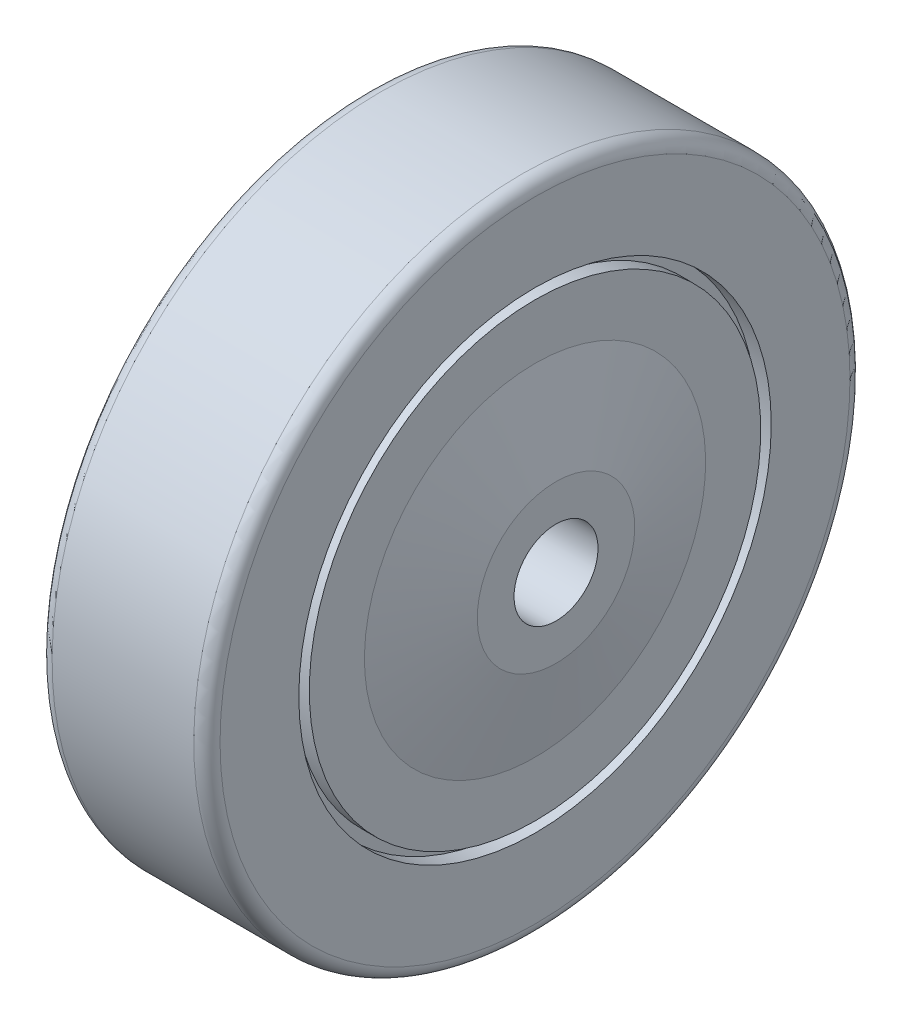
ISO-10303-21;
HEADER;
FILE_DESCRIPTION(('STEP AP214'),'2;1');
FILE_NAME('part.step','',(''),(''),'','','');
FILE_SCHEMA(('AUTOMOTIVE_DESIGN { 1 0 10303 214 1 1 1 1 }'));
ENDSEC;
DATA;
#1=APPLICATION_CONTEXT('core data for automotive mechanical design processes');
#2=APPLICATION_PROTOCOL_DEFINITION('international standard','automotive_design',2000,#1);
#3=PRODUCT_CONTEXT('',#1,'mechanical');
#4=PRODUCT('Part','Part','',(#3));
#5=PRODUCT_RELATED_PRODUCT_CATEGORY('part','',(#4));
#6=PRODUCT_DEFINITION_FORMATION('','',#4);
#7=PRODUCT_DEFINITION_CONTEXT('part definition',#1,'design');
#8=PRODUCT_DEFINITION('design','',#6,#7);
#9=PRODUCT_DEFINITION_SHAPE('','',#8);
#10=(LENGTH_UNIT() NAMED_UNIT(*) SI_UNIT(.MILLI.,.METRE.));
#11=(NAMED_UNIT(*) PLANE_ANGLE_UNIT() SI_UNIT($,.RADIAN.));
#12=(NAMED_UNIT(*) SI_UNIT($,.STERADIAN.) SOLID_ANGLE_UNIT());
#13=UNCERTAINTY_MEASURE_WITH_UNIT(LENGTH_MEASURE(1.E-05),#10,'distance_accuracy_value','');
#14=(GEOMETRIC_REPRESENTATION_CONTEXT(3) GLOBAL_UNCERTAINTY_ASSIGNED_CONTEXT((#13)) GLOBAL_UNIT_ASSIGNED_CONTEXT((#10,
#11,#12)) REPRESENTATION_CONTEXT('',''));
#15=CARTESIAN_POINT('',(0.,0.,0.));
#16=DIRECTION('',(0.,0.,1.));
#17=DIRECTION('',(1.,0.,0.));
#18=AXIS2_PLACEMENT_3D('',#15,#16,#17);
#19=CARTESIAN_POINT('',(-20.,0.,0.));
#20=DIRECTION('',(1.,0.,0.));
#21=DIRECTION('',(0.,1.,0.));
#22=AXIS2_PLACEMENT_3D('',#19,#20,#21);
#23=CYLINDRICAL_SURFACE('',#22,8.);
#24=CARTESIAN_POINT('',(20.,0.,0.));
#25=DIRECTION('',(-1.,0.,0.));
#26=DIRECTION('',(0.,1.,0.));
#27=AXIS2_PLACEMENT_3D('',#24,#25,#26);
#28=CIRCLE('',#27,8.);
#29=CARTESIAN_POINT('',(20.,8.00000000000001,0.));
#30=VERTEX_POINT('',#29);
#31=EDGE_CURVE('E67',#30,#30,#28,.T.);
#32=ORIENTED_EDGE('',*,*,#31,.F.);
#33=EDGE_LOOP('',(#32));
#34=FACE_BOUND('',#33,.T.);
#35=CARTESIAN_POINT('',(-20.,0.,0.));
#36=DIRECTION('',(1.,0.,0.));
#37=DIRECTION('',(0.,1.,0.));
#38=AXIS2_PLACEMENT_3D('',#35,#36,#37);
#39=CIRCLE('',#38,8.);
#40=CARTESIAN_POINT('',(-20.,7.99999999999999,0.));
#41=VERTEX_POINT('',#40);
#42=EDGE_CURVE('E30',#41,#41,#39,.T.);
#43=ORIENTED_EDGE('',*,*,#42,.F.);
#44=EDGE_LOOP('',(#43));
#45=FACE_BOUND('',#44,.T.);
#46=ADVANCED_FACE('F14',(#34,#45),#23,.F.);
#47=CARTESIAN_POINT('',(14.5714506781853,0.,0.));
#48=DIRECTION('',(-1.,0.,0.));
#49=DIRECTION('',(0.,1.,0.));
#50=AXIS2_PLACEMENT_3D('',#47,#48,#49);
#51=CYLINDRICAL_SURFACE('',#50,42.9998065658785);
#52=CARTESIAN_POINT('',(16.,0.,0.));
#53=DIRECTION('',(-1.,0.,0.));
#54=DIRECTION('',(0.,1.,0.));
#55=AXIS2_PLACEMENT_3D('',#52,#53,#54);
#56=CIRCLE('',#55,42.9998065658785);
#57=CARTESIAN_POINT('',(16.,42.9998065658785,0.));
#58=VERTEX_POINT('',#57);
#59=EDGE_CURVE('E10',#58,#58,#56,.T.);
#60=ORIENTED_EDGE('',*,*,#59,.T.);
#61=EDGE_LOOP('',(#60));
#62=FACE_BOUND('',#61,.T.);
#63=CARTESIAN_POINT('',(13.1429013563706,0.,0.));
#64=DIRECTION('',(-1.,0.,0.));
#65=DIRECTION('',(0.,1.,0.));
#66=AXIS2_PLACEMENT_3D('',#63,#64,#65);
#67=CIRCLE('',#66,42.9998065658785);
#68=CARTESIAN_POINT('',(13.1429013563706,42.9998065658785,0.));
#69=VERTEX_POINT('',#68);
#70=EDGE_CURVE('E22',#69,#69,#67,.T.);
#71=ORIENTED_EDGE('',*,*,#70,.F.);
#72=EDGE_LOOP('',(#71));
#73=FACE_BOUND('',#72,.T.);
#74=ADVANCED_FACE('F92',(#62,#73),#51,.T.);
#75=CARTESIAN_POINT('',(13.1429013563706,-44.9998065658785,0.));
#76=DIRECTION('',(1.,0.,0.));
#77=DIRECTION('',(0.,1.,0.));
#78=AXIS2_PLACEMENT_3D('',#75,#76,#77);
#79=PLANE('',#78);
#80=ORIENTED_EDGE('',*,*,#70,.T.);
#81=EDGE_LOOP('',(#80));
#82=FACE_BOUND('',#81,.T.);
#83=CARTESIAN_POINT('',(13.1429013563706,0.,0.));
#84=DIRECTION('',(-1.,0.,0.));
#85=DIRECTION('',(0.,1.,0.));
#86=AXIS2_PLACEMENT_3D('',#83,#84,#85);
#87=CIRCLE('',#86,44.9998065658785);
#88=CARTESIAN_POINT('',(13.1429013563706,44.9998065658785,0.));
#89=VERTEX_POINT('',#88);
#90=EDGE_CURVE('E27',#89,#89,#87,.T.);
#91=ORIENTED_EDGE('',*,*,#90,.F.);
#92=EDGE_LOOP('',(#91));
#93=FACE_BOUND('',#92,.T.);
#94=ADVANCED_FACE('F99',(#82,#93),#79,.T.);
#95=CARTESIAN_POINT('',(14.5714506781853,0.,0.));
#96=DIRECTION('',(-1.,0.,0.));
#97=DIRECTION('',(0.,1.,0.));
#98=AXIS2_PLACEMENT_3D('',#95,#96,#97);
#99=CYLINDRICAL_SURFACE('',#98,44.9998065658785);
#100=ORIENTED_EDGE('',*,*,#90,.T.);
#101=EDGE_LOOP('',(#100));
#102=FACE_BOUND('',#101,.T.);
#103=CARTESIAN_POINT('',(16.,0.,0.));
#104=DIRECTION('',(-1.,0.,0.));
#105=DIRECTION('',(0.,1.,0.));
#106=AXIS2_PLACEMENT_3D('',#103,#104,#105);
#107=CIRCLE('',#106,44.9998065658785);
#108=CARTESIAN_POINT('',(16.,44.9998065658785,0.));
#109=VERTEX_POINT('',#108);
#110=EDGE_CURVE('E35',#109,#109,#107,.T.);
#111=ORIENTED_EDGE('',*,*,#110,.F.);
#112=EDGE_LOOP('',(#111));
#113=FACE_BOUND('',#112,.T.);
#114=ADVANCED_FACE('F111',(#102,#113),#99,.F.);
#115=CARTESIAN_POINT('',(16.,-60.,0.));
#116=DIRECTION('',(1.,0.,0.));
#117=DIRECTION('',(0.,1.,0.));
#118=AXIS2_PLACEMENT_3D('',#115,#116,#117);
#119=PLANE('',#118);
#120=ORIENTED_EDGE('',*,*,#110,.T.);
#121=EDGE_LOOP('',(#120));
#122=FACE_BOUND('',#121,.T.);
#123=CARTESIAN_POINT('',(16.,0.,0.));
#124=DIRECTION('',(-1.,0.,0.));
#125=DIRECTION('',(0.,1.,0.));
#126=AXIS2_PLACEMENT_3D('',#123,#124,#125);
#127=CIRCLE('',#126,60.);
#128=CARTESIAN_POINT('',(16.,60.,0.));
#129=VERTEX_POINT('',#128);
#130=EDGE_CURVE('E38',#129,#129,#127,.T.);
#131=ORIENTED_EDGE('',*,*,#130,.F.);
#132=EDGE_LOOP('',(#131));
#133=FACE_BOUND('',#132,.T.);
#134=ADVANCED_FACE('F114',(#122,#133),#119,.T.);
#135=CARTESIAN_POINT('',(13.5,0.,0.));
#136=DIRECTION('',(-1.,0.,0.));
#137=DIRECTION('',(0.,1.,0.));
#138=AXIS2_PLACEMENT_3D('',#135,#136,#137);
#139=TOROIDAL_SURFACE('',#138,60.,2.5);
#140=ORIENTED_EDGE('',*,*,#130,.T.);
#141=EDGE_LOOP('',(#140));
#142=FACE_BOUND('',#141,.T.);
#143=CARTESIAN_POINT('',(13.5,0.,0.));
#144=DIRECTION('',(-1.,0.,0.));
#145=DIRECTION('',(0.,1.,0.));
#146=AXIS2_PLACEMENT_3D('',#143,#144,#145);
#147=CIRCLE('',#146,62.5);
#148=CARTESIAN_POINT('',(13.5,62.5,0.));
#149=VERTEX_POINT('',#148);
#150=EDGE_CURVE('E41',#149,#149,#147,.T.);
#151=ORIENTED_EDGE('',*,*,#150,.F.);
#152=EDGE_LOOP('',(#151));
#153=FACE_BOUND('',#152,.T.);
#154=ADVANCED_FACE('F142',(#142,#153),#139,.T.);
#155=CARTESIAN_POINT('',(0.,0.,0.));
#156=DIRECTION('',(-1.,0.,0.));
#157=DIRECTION('',(0.,1.,0.));
#158=AXIS2_PLACEMENT_3D('',#155,#156,#157);
#159=CYLINDRICAL_SURFACE('',#158,62.5);
#160=ORIENTED_EDGE('',*,*,#150,.T.);
#161=EDGE_LOOP('',(#160));
#162=FACE_BOUND('',#161,.T.);
#163=CARTESIAN_POINT('',(-13.5,0.,0.));
#164=DIRECTION('',(-1.,0.,0.));
#165=DIRECTION('',(0.,1.,0.));
#166=AXIS2_PLACEMENT_3D('',#163,#164,#165);
#167=CIRCLE('',#166,62.5);
#168=CARTESIAN_POINT('',(-13.5,62.5,0.));
#169=VERTEX_POINT('',#168);
#170=EDGE_CURVE('E44',#169,#169,#167,.T.);
#171=ORIENTED_EDGE('',*,*,#170,.F.);
#172=EDGE_LOOP('',(#171));
#173=FACE_BOUND('',#172,.T.);
#174=ADVANCED_FACE('F140',(#162,#173),#159,.T.);
#175=CARTESIAN_POINT('',(-13.5,0.,0.));
#176=DIRECTION('',(-1.,0.,0.));
#177=DIRECTION('',(0.,1.,0.));
#178=AXIS2_PLACEMENT_3D('',#175,#176,#177);
#179=TOROIDAL_SURFACE('',#178,60.,2.5);
#180=ORIENTED_EDGE('',*,*,#170,.T.);
#181=EDGE_LOOP('',(#180));
#182=FACE_BOUND('',#181,.T.);
#183=CARTESIAN_POINT('',(-16.,0.,0.));
#184=DIRECTION('',(-1.,0.,0.));
#185=DIRECTION('',(0.,1.,0.));
#186=AXIS2_PLACEMENT_3D('',#183,#184,#185);
#187=CIRCLE('',#186,60.);
#188=CARTESIAN_POINT('',(-16.,60.,0.));
#189=VERTEX_POINT('',#188);
#190=EDGE_CURVE('E47',#189,#189,#187,.T.);
#191=ORIENTED_EDGE('',*,*,#190,.F.);
#192=EDGE_LOOP('',(#191));
#193=FACE_BOUND('',#192,.T.);
#194=ADVANCED_FACE('F141',(#182,#193),#179,.T.);
#195=CARTESIAN_POINT('',(-16.,-44.9998065658785,0.));
#196=DIRECTION('',(-1.,0.,0.));
#197=DIRECTION('',(0.,-1.,0.));
#198=AXIS2_PLACEMENT_3D('',#195,#196,#197);
#199=PLANE('',#198);
#200=ORIENTED_EDGE('',*,*,#190,.T.);
#201=EDGE_LOOP('',(#200));
#202=FACE_BOUND('',#201,.T.);
#203=CARTESIAN_POINT('',(-16.,0.,0.));
#204=DIRECTION('',(-1.,0.,0.));
#205=DIRECTION('',(0.,1.,0.));
#206=AXIS2_PLACEMENT_3D('',#203,#204,#205);
#207=CIRCLE('',#206,44.9998065658785);
#208=CARTESIAN_POINT('',(-16.,44.9998065658785,0.));
#209=VERTEX_POINT('',#208);
#210=EDGE_CURVE('E50',#209,#209,#207,.T.);
#211=ORIENTED_EDGE('',*,*,#210,.F.);
#212=EDGE_LOOP('',(#211));
#213=FACE_BOUND('',#212,.T.);
#214=ADVANCED_FACE('F118',(#202,#213),#199,.T.);
#215=CARTESIAN_POINT('',(-14.5714506781853,0.,0.));
#216=DIRECTION('',(-1.,0.,0.));
#217=DIRECTION('',(0.,1.,0.));
#218=AXIS2_PLACEMENT_3D('',#215,#216,#217);
#219=CYLINDRICAL_SURFACE('',#218,44.9998065658785);
#220=ORIENTED_EDGE('',*,*,#210,.T.);
#221=EDGE_LOOP('',(#220));
#222=FACE_BOUND('',#221,.T.);
#223=CARTESIAN_POINT('',(-13.1429013563707,0.,0.));
#224=DIRECTION('',(-1.,0.,0.));
#225=DIRECTION('',(0.,1.,0.));
#226=AXIS2_PLACEMENT_3D('',#223,#224,#225);
#227=CIRCLE('',#226,44.9998065658785);
#228=CARTESIAN_POINT('',(-13.1429013563707,44.9998065658785,0.));
#229=VERTEX_POINT('',#228);
#230=EDGE_CURVE('E53',#229,#229,#227,.T.);
#231=ORIENTED_EDGE('',*,*,#230,.F.);
#232=EDGE_LOOP('',(#231));
#233=FACE_BOUND('',#232,.T.);
#234=ADVANCED_FACE('F116',(#222,#233),#219,.F.);
#235=CARTESIAN_POINT('',(-13.1429013563706,-42.9998065658785,0.));
#236=DIRECTION('',(-1.,0.,0.));
#237=DIRECTION('',(0.,-1.,0.));
#238=AXIS2_PLACEMENT_3D('',#235,#236,#237);
#239=PLANE('',#238);
#240=ORIENTED_EDGE('',*,*,#230,.T.);
#241=EDGE_LOOP('',(#240));
#242=FACE_BOUND('',#241,.T.);
#243=CARTESIAN_POINT('',(-13.1429013563707,0.,0.));
#244=DIRECTION('',(-1.,0.,0.));
#245=DIRECTION('',(0.,1.,0.));
#246=AXIS2_PLACEMENT_3D('',#243,#244,#245);
#247=CIRCLE('',#246,42.9998065658785);
#248=CARTESIAN_POINT('',(-13.1429013563707,42.9998065658785,0.));
#249=VERTEX_POINT('',#248);
#250=EDGE_CURVE('E56',#249,#249,#247,.T.);
#251=ORIENTED_EDGE('',*,*,#250,.F.);
#252=EDGE_LOOP('',(#251));
#253=FACE_BOUND('',#252,.T.);
#254=ADVANCED_FACE('F109',(#242,#253),#239,.T.);
#255=CARTESIAN_POINT('',(-14.5714506781853,0.,0.));
#256=DIRECTION('',(-1.,0.,0.));
#257=DIRECTION('',(0.,1.,0.));
#258=AXIS2_PLACEMENT_3D('',#255,#256,#257);
#259=CYLINDRICAL_SURFACE('',#258,42.9998065658785);
#260=ORIENTED_EDGE('',*,*,#250,.T.);
#261=EDGE_LOOP('',(#260));
#262=FACE_BOUND('',#261,.T.);
#263=CARTESIAN_POINT('',(-16.,0.,0.));
#264=DIRECTION('',(-1.,0.,0.));
#265=DIRECTION('',(0.,1.,0.));
#266=AXIS2_PLACEMENT_3D('',#263,#264,#265);
#267=CIRCLE('',#266,42.9998065658785);
#268=CARTESIAN_POINT('',(-16.,42.9998065658785,0.));
#269=VERTEX_POINT('',#268);
#270=EDGE_CURVE('E59',#269,#269,#267,.T.);
#271=ORIENTED_EDGE('',*,*,#270,.F.);
#272=EDGE_LOOP('',(#271));
#273=FACE_BOUND('',#272,.T.);
#274=ADVANCED_FACE('F105',(#262,#273),#259,.T.);
#275=CARTESIAN_POINT('',(-16.,-32.5,0.));
#276=DIRECTION('',(-1.,0.,0.));
#277=DIRECTION('',(0.,-1.,0.));
#278=AXIS2_PLACEMENT_3D('',#275,#276,#277);
#279=PLANE('',#278);
#280=ORIENTED_EDGE('',*,*,#270,.T.);
#281=EDGE_LOOP('',(#280));
#282=FACE_BOUND('',#281,.T.);
#283=CARTESIAN_POINT('',(-16.,0.,0.));
#284=DIRECTION('',(-1.,0.,0.));
#285=DIRECTION('',(0.,1.,0.));
#286=AXIS2_PLACEMENT_3D('',#283,#284,#285);
#287=CIRCLE('',#286,32.5);
#288=CARTESIAN_POINT('',(-16.,32.5,0.));
#289=VERTEX_POINT('',#288);
#290=EDGE_CURVE('E62',#289,#289,#287,.T.);
#291=ORIENTED_EDGE('',*,*,#290,.F.);
#292=EDGE_LOOP('',(#291));
#293=FACE_BOUND('',#292,.T.);
#294=ADVANCED_FACE('F108',(#282,#293),#279,.T.);
#295=CARTESIAN_POINT('',(-18.,0.,0.));
#296=DIRECTION('',(1.,0.,0.));
#297=DIRECTION('',(0.,1.,0.));
#298=AXIS2_PLACEMENT_3D('',#295,#296,#297);
#299=CONICAL_SURFACE('',#298,23.75,1.34608515838025);
#300=ORIENTED_EDGE('',*,*,#290,.T.);
#301=EDGE_LOOP('',(#300));
#302=FACE_BOUND('',#301,.T.);
#303=CARTESIAN_POINT('',(-20.,0.,0.));
#304=DIRECTION('',(-1.,0.,0.));
#305=DIRECTION('',(0.,1.,0.));
#306=AXIS2_PLACEMENT_3D('',#303,#304,#305);
#307=CIRCLE('',#306,15.);
#308=CARTESIAN_POINT('',(-20.,15.,0.));
#309=VERTEX_POINT('',#308);
#310=EDGE_CURVE('E65',#309,#309,#307,.T.);
#311=ORIENTED_EDGE('',*,*,#310,.F.);
#312=EDGE_LOOP('',(#311));
#313=FACE_BOUND('',#312,.T.);
#314=ADVANCED_FACE('F120',(#302,#313),#299,.T.);
#315=CARTESIAN_POINT('',(-20.,0.,0.));
#316=DIRECTION('',(-1.,0.,0.));
#317=DIRECTION('',(0.,-1.,0.));
#318=AXIS2_PLACEMENT_3D('',#315,#316,#317);
#319=PLANE('',#318);
#320=ORIENTED_EDGE('',*,*,#42,.T.);
#321=EDGE_LOOP('',(#320));
#322=FACE_BOUND('',#321,.T.);
#323=ORIENTED_EDGE('',*,*,#310,.T.);
#324=EDGE_LOOP('',(#323));
#325=FACE_BOUND('',#324,.T.);
#326=ADVANCED_FACE('F88',(#322,#325),#319,.T.);
#327=CARTESIAN_POINT('',(20.,-15.,0.));
#328=DIRECTION('',(1.,0.,0.));
#329=DIRECTION('',(0.,1.,0.));
#330=AXIS2_PLACEMENT_3D('',#327,#328,#329);
#331=PLANE('',#330);
#332=ORIENTED_EDGE('',*,*,#31,.T.);
#333=EDGE_LOOP('',(#332));
#334=FACE_BOUND('',#333,.T.);
#335=CARTESIAN_POINT('',(20.,0.,0.));
#336=DIRECTION('',(-1.,0.,0.));
#337=DIRECTION('',(0.,1.,0.));
#338=AXIS2_PLACEMENT_3D('',#335,#336,#337);
#339=CIRCLE('',#338,15.);
#340=CARTESIAN_POINT('',(20.,15.,0.));
#341=VERTEX_POINT('',#340);
#342=EDGE_CURVE('E68',#341,#341,#339,.T.);
#343=ORIENTED_EDGE('',*,*,#342,.F.);
#344=EDGE_LOOP('',(#343));
#345=FACE_BOUND('',#344,.T.);
#346=ADVANCED_FACE('F80',(#334,#345),#331,.T.);
#347=CARTESIAN_POINT('',(18.,0.,0.));
#348=DIRECTION('',(-1.,0.,0.));
#349=DIRECTION('',(0.,1.,0.));
#350=AXIS2_PLACEMENT_3D('',#347,#348,#349);
#351=CONICAL_SURFACE('',#350,23.75,1.34608515838025);
#352=ORIENTED_EDGE('',*,*,#342,.T.);
#353=EDGE_LOOP('',(#352));
#354=FACE_BOUND('',#353,.T.);
#355=CARTESIAN_POINT('',(16.,0.,0.));
#356=DIRECTION('',(-1.,0.,0.));
#357=DIRECTION('',(0.,1.,0.));
#358=AXIS2_PLACEMENT_3D('',#355,#356,#357);
#359=CIRCLE('',#358,32.5);
#360=CARTESIAN_POINT('',(16.,32.5,0.));
#361=VERTEX_POINT('',#360);
#362=EDGE_CURVE('E18',#361,#361,#359,.T.);
#363=ORIENTED_EDGE('',*,*,#362,.F.);
#364=EDGE_LOOP('',(#363));
#365=FACE_BOUND('',#364,.T.);
#366=ADVANCED_FACE('F16',(#354,#365),#351,.T.);
#367=CARTESIAN_POINT('',(16.,-42.9998065658785,0.));
#368=DIRECTION('',(1.,0.,0.));
#369=DIRECTION('',(0.,1.,0.));
#370=AXIS2_PLACEMENT_3D('',#367,#368,#369);
#371=PLANE('',#370);
#372=ORIENTED_EDGE('',*,*,#362,.T.);
#373=EDGE_LOOP('',(#372));
#374=FACE_BOUND('',#373,.T.);
#375=ORIENTED_EDGE('',*,*,#59,.F.);
#376=EDGE_LOOP('',(#375));
#377=FACE_BOUND('',#376,.T.);
#378=ADVANCED_FACE('F76',(#374,#377),#371,.T.);
#379=CLOSED_SHELL('',(#46,#74,#94,#114,#134,#154,#174,#194,#214,#234,#254,#274,#294,#314,#326,
#346,#366,#378));
#380=MANIFOLD_SOLID_BREP('B1',#379);
#381=ADVANCED_BREP_SHAPE_REPRESENTATION('',(#18,#380),#14);
#382=SHAPE_DEFINITION_REPRESENTATION(#9,#381);
ENDSEC;
END-ISO-10303-21;
